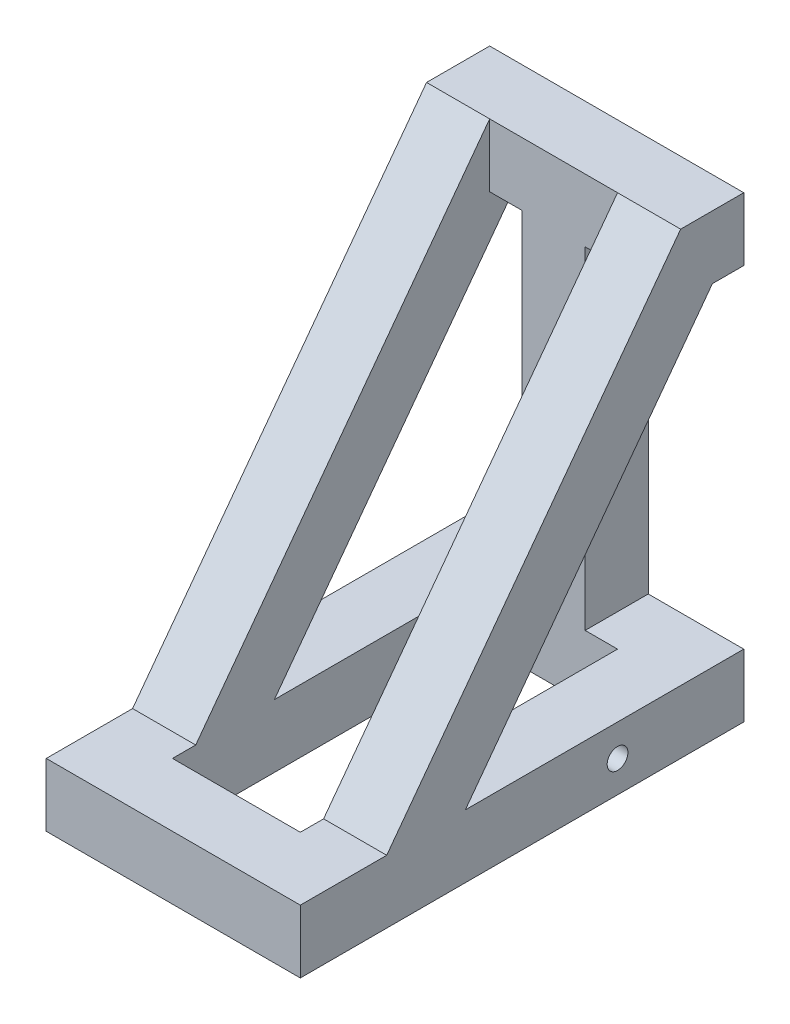
ISO-10303-21;
HEADER;
FILE_DESCRIPTION(('STEP AP214'),'2;1');
FILE_NAME('part.step','',(''),(''),'','','');
FILE_SCHEMA(('AUTOMOTIVE_DESIGN { 1 0 10303 214 1 1 1 1 }'));
ENDSEC;
DATA;
#1=APPLICATION_CONTEXT('core data for automotive mechanical design processes');
#2=APPLICATION_PROTOCOL_DEFINITION('international standard','automotive_design',2000,#1);
#3=PRODUCT_CONTEXT('',#1,'mechanical');
#4=PRODUCT('Part','Part','',(#3));
#5=PRODUCT_RELATED_PRODUCT_CATEGORY('part','',(#4));
#6=PRODUCT_DEFINITION_FORMATION('','',#4);
#7=PRODUCT_DEFINITION_CONTEXT('part definition',#1,'design');
#8=PRODUCT_DEFINITION('design','',#6,#7);
#9=PRODUCT_DEFINITION_SHAPE('','',#8);
#10=(LENGTH_UNIT() NAMED_UNIT(*) SI_UNIT(.MILLI.,.METRE.));
#11=(NAMED_UNIT(*) PLANE_ANGLE_UNIT() SI_UNIT($,.RADIAN.));
#12=(NAMED_UNIT(*) SI_UNIT($,.STERADIAN.) SOLID_ANGLE_UNIT());
#13=UNCERTAINTY_MEASURE_WITH_UNIT(LENGTH_MEASURE(1.E-05),#10,'distance_accuracy_value','');
#14=(GEOMETRIC_REPRESENTATION_CONTEXT(3) GLOBAL_UNCERTAINTY_ASSIGNED_CONTEXT((#13)) GLOBAL_UNIT_ASSIGNED_CONTEXT((#10,
#11,#12)) REPRESENTATION_CONTEXT('',''));
#15=CARTESIAN_POINT('',(0.,0.,0.));
#16=DIRECTION('',(0.,0.,1.));
#17=DIRECTION('',(1.,0.,0.));
#18=AXIS2_PLACEMENT_3D('',#15,#16,#17);
#19=CARTESIAN_POINT('',(-76.5,38.,133.5));
#20=DIRECTION('',(0.,1.,0.));
#21=DIRECTION('',(0.,0.,1.));
#22=AXIS2_PLACEMENT_3D('',#19,#20,#21);
#23=PLANE('',#22);
#24=DIRECTION('',(0.,0.,1.));
#25=VECTOR('',#24,1.);
#26=CARTESIAN_POINT('',(-38.5,38.,-95.5));
#27=LINE('',#26,#25);
#28=CARTESIAN_POINT('',(-38.5,38.,81.5));
#29=VERTEX_POINT('',#28);
#30=CARTESIAN_POINT('',(-38.5,38.,95.5));
#31=VERTEX_POINT('',#30);
#32=EDGE_CURVE('E218',#29,#31,#27,.T.);
#33=ORIENTED_EDGE('',*,*,#32,.F.);
#34=DIRECTION('',(-1.,0.,0.));
#35=VECTOR('',#34,1.);
#36=CARTESIAN_POINT('',(-38.5,38.,81.5));
#37=LINE('',#36,#35);
#38=CARTESIAN_POINT('',(-76.5,38.,81.5));
#39=VERTEX_POINT('',#38);
#40=EDGE_CURVE('E52',#29,#39,#37,.T.);
#41=ORIENTED_EDGE('',*,*,#40,.T.);
#42=DIRECTION('',(0.,0.,1.));
#43=VECTOR('',#42,1.);
#44=CARTESIAN_POINT('',(-76.5,38.,-133.5));
#45=LINE('',#44,#43);
#46=CARTESIAN_POINT('',(-76.5,38.,133.5));
#47=VERTEX_POINT('',#46);
#48=EDGE_CURVE('E262',#39,#47,#45,.T.);
#49=ORIENTED_EDGE('',*,*,#48,.T.);
#50=DIRECTION('',(1.,0.,0.));
#51=VECTOR('',#50,1.);
#52=CARTESIAN_POINT('',(-76.5,38.,133.5));
#53=LINE('',#52,#51);
#54=CARTESIAN_POINT('',(76.5,38.,133.5));
#55=VERTEX_POINT('',#54);
#56=EDGE_CURVE('E293',#47,#55,#53,.T.);
#57=ORIENTED_EDGE('',*,*,#56,.T.);
#58=DIRECTION('',(0.,0.,-1.));
#59=VECTOR('',#58,1.);
#60=CARTESIAN_POINT('',(76.5,38.,-133.5));
#61=LINE('',#60,#59);
#62=CARTESIAN_POINT('',(76.5,38.,81.5));
#63=VERTEX_POINT('',#62);
#64=EDGE_CURVE('E246',#55,#63,#61,.T.);
#65=ORIENTED_EDGE('',*,*,#64,.T.);
#66=DIRECTION('',(1.,0.,0.));
#67=VECTOR('',#66,1.);
#68=CARTESIAN_POINT('',(38.5,38.,81.5));
#69=LINE('',#68,#67);
#70=CARTESIAN_POINT('',(38.5,38.,81.5));
#71=VERTEX_POINT('',#70);
#72=EDGE_CURVE('E389',#71,#63,#69,.T.);
#73=ORIENTED_EDGE('',*,*,#72,.F.);
#74=DIRECTION('',(0.,0.,-1.));
#75=VECTOR('',#74,1.);
#76=CARTESIAN_POINT('',(38.5,38.,-95.5));
#77=LINE('',#76,#75);
#78=CARTESIAN_POINT('',(38.5,38.,95.5));
#79=VERTEX_POINT('',#78);
#80=EDGE_CURVE('E227',#79,#71,#77,.T.);
#81=ORIENTED_EDGE('',*,*,#80,.F.);
#82=DIRECTION('',(1.,0.,0.));
#83=VECTOR('',#82,1.);
#84=CARTESIAN_POINT('',(-38.5,38.,95.5));
#85=LINE('',#84,#83);
#86=EDGE_CURVE('E217',#31,#79,#85,.T.);
#87=ORIENTED_EDGE('',*,*,#86,.F.);
#88=EDGE_LOOP('',(#33,#41,#49,#57,#65,#73,#81,#87));
#89=FACE_BOUND('',#88,.T.);
#90=ADVANCED_FACE('F35',(#89),#23,.T.);
#91=CARTESIAN_POINT('',(-76.5,38.,-133.5));
#92=VERTEX_POINT('',#91);
#93=CARTESIAN_POINT('',(-76.5,38.,34.14330989466));
#94=VERTEX_POINT('',#93);
#95=EDGE_CURVE('E211',#92,#94,#45,.T.);
#96=ORIENTED_EDGE('',*,*,#95,.T.);
#97=DIRECTION('',(-1.,0.,0.));
#98=VECTOR('',#97,1.);
#99=CARTESIAN_POINT('',(-38.5,38.,34.14330989466));
#100=LINE('',#99,#98);
#101=CARTESIAN_POINT('',(-38.5,38.,34.14330989466));
#102=VERTEX_POINT('',#101);
#103=EDGE_CURVE('E198',#102,#94,#100,.T.);
#104=ORIENTED_EDGE('',*,*,#103,.F.);
#105=CARTESIAN_POINT('',(-38.5,38.,-95.5));
#106=VERTEX_POINT('',#105);
#107=EDGE_CURVE('E209',#106,#102,#27,.T.);
#108=ORIENTED_EDGE('',*,*,#107,.F.);
#109=DIRECTION('',(-1.,0.,0.));
#110=VECTOR('',#109,1.);
#111=CARTESIAN_POINT('',(-38.5,38.,-95.5));
#112=LINE('',#111,#110);
#113=CARTESIAN_POINT('',(-19.,38.,-95.5));
#114=VERTEX_POINT('',#113);
#115=EDGE_CURVE('E230',#114,#106,#112,.T.);
#116=ORIENTED_EDGE('',*,*,#115,.F.);
#117=DIRECTION('',(0.,0.,1.));
#118=VECTOR('',#117,1.);
#119=CARTESIAN_POINT('',(-19.,38.,-133.5));
#120=LINE('',#119,#118);
#121=CARTESIAN_POINT('',(-19.,38.,-133.5));
#122=VERTEX_POINT('',#121);
#123=EDGE_CURVE('E326',#122,#114,#120,.T.);
#124=ORIENTED_EDGE('',*,*,#123,.F.);
#125=DIRECTION('',(-1.,0.,0.));
#126=VECTOR('',#125,1.);
#127=CARTESIAN_POINT('',(-76.5,38.,-133.5));
#128=LINE('',#127,#126);
#129=EDGE_CURVE('E242',#122,#92,#128,.T.);
#130=ORIENTED_EDGE('',*,*,#129,.T.);
#131=EDGE_LOOP('',(#96,#104,#108,#116,#124,#130));
#132=FACE_BOUND('',#131,.T.);
#133=ADVANCED_FACE('F208',(#132),#23,.T.);
#134=CARTESIAN_POINT('',(-76.5,238.,-95.5));
#135=DIRECTION('',(0.,-1.,0.));
#136=DIRECTION('',(0.,0.,-1.));
#137=AXIS2_PLACEMENT_3D('',#134,#135,#136);
#138=PLANE('',#137);
#139=DIRECTION('',(0.,0.,1.));
#140=VECTOR('',#139,1.);
#141=CARTESIAN_POINT('',(-38.5,238.,-114.596185903659));
#142=LINE('',#141,#140);
#143=CARTESIAN_POINT('',(-38.5,238.,-114.596185903659));
#144=VERTEX_POINT('',#143);
#145=CARTESIAN_POINT('',(-38.5,238.,-95.5));
#146=VERTEX_POINT('',#145);
#147=EDGE_CURVE('E60',#144,#146,#142,.T.);
#148=ORIENTED_EDGE('',*,*,#147,.F.);
#149=DIRECTION('',(-1.,0.,0.));
#150=VECTOR('',#149,1.);
#151=CARTESIAN_POINT('',(-38.5,238.,-114.596185903659));
#152=LINE('',#151,#150);
#153=CARTESIAN_POINT('',(-76.5,238.,-114.596185903659));
#154=VERTEX_POINT('',#153);
#155=EDGE_CURVE('E200',#144,#154,#152,.T.);
#156=ORIENTED_EDGE('',*,*,#155,.T.);
#157=DIRECTION('',(0.,0.,-1.));
#158=VECTOR('',#157,1.);
#159=CARTESIAN_POINT('',(-76.5,238.,-95.5));
#160=LINE('',#159,#158);
#161=CARTESIAN_POINT('',(-76.5,238.,-133.5));
#162=VERTEX_POINT('',#161);
#163=EDGE_CURVE('E376',#154,#162,#160,.T.);
#164=ORIENTED_EDGE('',*,*,#163,.T.);
#165=DIRECTION('',(1.,0.,0.));
#166=VECTOR('',#165,1.);
#167=CARTESIAN_POINT('',(-76.5,238.,-133.5));
#168=LINE('',#167,#166);
#169=CARTESIAN_POINT('',(-19.,238.,-133.5));
#170=VERTEX_POINT('',#169);
#171=EDGE_CURVE('E354',#162,#170,#168,.T.);
#172=ORIENTED_EDGE('',*,*,#171,.T.);
#173=DIRECTION('',(0.,0.,1.));
#174=VECTOR('',#173,1.);
#175=CARTESIAN_POINT('',(-19.,238.,-133.5));
#176=LINE('',#175,#174);
#177=CARTESIAN_POINT('',(-19.,238.,-95.5));
#178=VERTEX_POINT('',#177);
#179=EDGE_CURVE('E342',#170,#178,#176,.T.);
#180=ORIENTED_EDGE('',*,*,#179,.T.);
#181=DIRECTION('',(1.,0.,0.));
#182=VECTOR('',#181,1.);
#183=CARTESIAN_POINT('',(-76.5,238.,-95.5));
#184=LINE('',#183,#182);
#185=EDGE_CURVE('E345',#146,#178,#184,.T.);
#186=ORIENTED_EDGE('',*,*,#185,.F.);
#187=EDGE_LOOP('',(#148,#156,#164,#172,#180,#186));
#188=FACE_BOUND('',#187,.T.);
#189=ADVANCED_FACE('F494',(#188),#138,.T.);
#190=DIRECTION('',(1.,0.,0.));
#191=VECTOR('',#190,1.);
#192=CARTESIAN_POINT('',(38.5,38.,34.14330989466));
#193=LINE('',#192,#191);
#194=CARTESIAN_POINT('',(38.5,38.,34.14330989466));
#195=VERTEX_POINT('',#194);
#196=CARTESIAN_POINT('',(76.5,38.,34.14330989466));
#197=VERTEX_POINT('',#196);
#198=EDGE_CURVE('E392',#195,#197,#193,.T.);
#199=ORIENTED_EDGE('',*,*,#198,.T.);
#200=CARTESIAN_POINT('',(76.5,38.,-133.5));
#201=VERTEX_POINT('',#200);
#202=EDGE_CURVE('E295',#197,#201,#61,.T.);
#203=ORIENTED_EDGE('',*,*,#202,.T.);
#204=CARTESIAN_POINT('',(19.,38.,-133.5));
#205=VERTEX_POINT('',#204);
#206=EDGE_CURVE('E245',#201,#205,#128,.T.);
#207=ORIENTED_EDGE('',*,*,#206,.T.);
#208=DIRECTION('',(0.,0.,-1.));
#209=VECTOR('',#208,1.);
#210=CARTESIAN_POINT('',(19.,38.,-133.5));
#211=LINE('',#210,#209);
#212=CARTESIAN_POINT('',(19.,38.,-95.5));
#213=VERTEX_POINT('',#212);
#214=EDGE_CURVE('E328',#213,#205,#211,.T.);
#215=ORIENTED_EDGE('',*,*,#214,.F.);
#216=CARTESIAN_POINT('',(38.5,38.,-95.5));
#217=VERTEX_POINT('',#216);
#218=EDGE_CURVE('E239',#217,#213,#112,.T.);
#219=ORIENTED_EDGE('',*,*,#218,.F.);
#220=EDGE_CURVE('E220',#195,#217,#77,.T.);
#221=ORIENTED_EDGE('',*,*,#220,.F.);
#222=EDGE_LOOP('',(#199,#203,#207,#215,#219,#221));
#223=FACE_BOUND('',#222,.T.);
#224=ADVANCED_FACE('F460',(#223),#23,.T.);
#225=CARTESIAN_POINT('',(-76.5,0.,133.5));
#226=DIRECTION('',(0.,1.,0.));
#227=DIRECTION('',(0.,0.,1.));
#228=AXIS2_PLACEMENT_3D('',#225,#226,#227);
#229=PLANE('',#228);
#230=DIRECTION('',(0.,0.,1.));
#231=VECTOR('',#230,1.);
#232=CARTESIAN_POINT('',(-76.5,0.,-133.5));
#233=LINE('',#232,#231);
#234=CARTESIAN_POINT('',(-76.5,0.,-133.5));
#235=VERTEX_POINT('',#234);
#236=CARTESIAN_POINT('',(-76.5,0.,133.5));
#237=VERTEX_POINT('',#236);
#238=EDGE_CURVE('E251',#235,#237,#233,.T.);
#239=ORIENTED_EDGE('',*,*,#238,.F.);
#240=DIRECTION('',(-1.,0.,0.));
#241=VECTOR('',#240,1.);
#242=CARTESIAN_POINT('',(-76.5,0.,-133.5));
#243=LINE('',#242,#241);
#244=CARTESIAN_POINT('',(76.5,0.,-133.5));
#245=VERTEX_POINT('',#244);
#246=EDGE_CURVE('E260',#245,#235,#243,.T.);
#247=ORIENTED_EDGE('',*,*,#246,.F.);
#248=DIRECTION('',(0.,0.,-1.));
#249=VECTOR('',#248,1.);
#250=CARTESIAN_POINT('',(76.5,0.,-133.5));
#251=LINE('',#250,#249);
#252=CARTESIAN_POINT('',(76.5,0.,133.5));
#253=VERTEX_POINT('',#252);
#254=EDGE_CURVE('E258',#253,#245,#251,.T.);
#255=ORIENTED_EDGE('',*,*,#254,.F.);
#256=DIRECTION('',(1.,0.,0.));
#257=VECTOR('',#256,1.);
#258=CARTESIAN_POINT('',(-76.5,0.,133.5));
#259=LINE('',#258,#257);
#260=EDGE_CURVE('E255',#237,#253,#259,.T.);
#261=ORIENTED_EDGE('',*,*,#260,.F.);
#262=EDGE_LOOP('',(#239,#247,#255,#261));
#263=FACE_BOUND('',#262,.T.);
#264=DIRECTION('',(0.,0.,1.));
#265=VECTOR('',#264,1.);
#266=CARTESIAN_POINT('',(-38.5,0.,-95.5));
#267=LINE('',#266,#265);
#268=CARTESIAN_POINT('',(-38.5,0.,-95.5));
#269=VERTEX_POINT('',#268);
#270=CARTESIAN_POINT('',(-38.5,0.,95.5));
#271=VERTEX_POINT('',#270);
#272=EDGE_CURVE('E233',#269,#271,#267,.T.);
#273=ORIENTED_EDGE('',*,*,#272,.T.);
#274=DIRECTION('',(1.,0.,0.));
#275=VECTOR('',#274,1.);
#276=CARTESIAN_POINT('',(-38.5,0.,95.5));
#277=LINE('',#276,#275);
#278=CARTESIAN_POINT('',(38.5,0.,95.5));
#279=VERTEX_POINT('',#278);
#280=EDGE_CURVE('E308',#271,#279,#277,.T.);
#281=ORIENTED_EDGE('',*,*,#280,.T.);
#282=DIRECTION('',(0.,0.,-1.));
#283=VECTOR('',#282,1.);
#284=CARTESIAN_POINT('',(38.5,0.,-95.5));
#285=LINE('',#284,#283);
#286=CARTESIAN_POINT('',(38.5,0.,-95.5));
#287=VERTEX_POINT('',#286);
#288=EDGE_CURVE('E306',#279,#287,#285,.T.);
#289=ORIENTED_EDGE('',*,*,#288,.T.);
#290=DIRECTION('',(-1.,0.,0.));
#291=VECTOR('',#290,1.);
#292=CARTESIAN_POINT('',(-38.5,0.,-95.5));
#293=LINE('',#292,#291);
#294=EDGE_CURVE('E222',#287,#269,#293,.T.);
#295=ORIENTED_EDGE('',*,*,#294,.T.);
#296=EDGE_LOOP('',(#273,#281,#289,#295));
#297=FACE_BOUND('',#296,.T.);
#298=ADVANCED_FACE('F283',(#263,#297),#229,.F.);
#299=CARTESIAN_POINT('',(-76.5,38.,-133.5));
#300=DIRECTION('',(1.,0.,0.));
#301=DIRECTION('',(0.,0.,-1.));
#302=AXIS2_PLACEMENT_3D('',#299,#300,#301);
#303=PLANE('',#302);
#304=CARTESIAN_POINT('',(-76.5,19.,-57.5));
#305=DIRECTION('',(1.,0.,0.));
#306=DIRECTION('',(0.,0.,-1.));
#307=AXIS2_PLACEMENT_3D('',#304,#305,#306);
#308=CIRCLE('',#307,6.25);
#309=CARTESIAN_POINT('',(-76.5,19.,-63.75));
#310=VERTEX_POINT('',#309);
#311=EDGE_CURVE('E416',#310,#310,#308,.T.);
#312=ORIENTED_EDGE('',*,*,#311,.T.);
#313=EDGE_LOOP('',(#312));
#314=FACE_BOUND('',#313,.T.);
#315=ORIENTED_EDGE('',*,*,#238,.T.);
#316=DIRECTION('',(0.,-1.,0.));
#317=VECTOR('',#316,1.);
#318=CARTESIAN_POINT('',(-76.5,38.,133.5));
#319=LINE('',#318,#317);
#320=EDGE_CURVE('E11',#47,#237,#319,.T.);
#321=ORIENTED_EDGE('',*,*,#320,.F.);
#322=ORIENTED_EDGE('',*,*,#48,.F.);
#323=DIRECTION('',(0.,-0.802420944442547,0.596758433471979));
#324=VECTOR('',#323,1.);
#325=CARTESIAN_POINT('',(-76.5,276.,-95.5));
#326=LINE('',#325,#324);
#327=CARTESIAN_POINT('',(-76.5,276.,-95.5));
#328=VERTEX_POINT('',#327);
#329=EDGE_CURVE('E412',#328,#39,#326,.T.);
#330=ORIENTED_EDGE('',*,*,#329,.F.);
#331=DIRECTION('',(0.,0.,1.));
#332=VECTOR('',#331,1.);
#333=CARTESIAN_POINT('',(-76.5,276.,-95.5));
#334=LINE('',#333,#332);
#335=CARTESIAN_POINT('',(-76.5,276.,-133.5));
#336=VERTEX_POINT('',#335);
#337=EDGE_CURVE('E358',#336,#328,#334,.T.);
#338=ORIENTED_EDGE('',*,*,#337,.F.);
#339=DIRECTION('',(0.,1.,0.));
#340=VECTOR('',#339,1.);
#341=CARTESIAN_POINT('',(-76.5,238.,-133.5));
#342=LINE('',#341,#340);
#343=EDGE_CURVE('E374',#162,#336,#342,.T.);
#344=ORIENTED_EDGE('',*,*,#343,.F.);
#345=ORIENTED_EDGE('',*,*,#163,.F.);
#346=DIRECTION('',(0.,0.802420944442548,-0.596758433471979));
#347=VECTOR('',#346,1.);
#348=CARTESIAN_POINT('',(-76.5,38.,34.14330989466));
#349=LINE('',#348,#347);
#350=EDGE_CURVE('E292',#94,#154,#349,.T.);
#351=ORIENTED_EDGE('',*,*,#350,.F.);
#352=ORIENTED_EDGE('',*,*,#95,.F.);
#353=DIRECTION('',(0.,-1.,0.));
#354=VECTOR('',#353,1.);
#355=CARTESIAN_POINT('',(-76.5,38.,-133.5));
#356=LINE('',#355,#354);
#357=EDGE_CURVE('E263',#92,#235,#356,.T.);
#358=ORIENTED_EDGE('',*,*,#357,.T.);
#359=EDGE_LOOP('',(#315,#321,#322,#330,#338,#344,#345,#351,#352,#358));
#360=FACE_BOUND('',#359,.T.);
#361=ADVANCED_FACE('F37',(#314,#360),#303,.F.);
#362=CARTESIAN_POINT('',(-76.5,38.,133.5));
#363=DIRECTION('',(0.,0.,-1.));
#364=DIRECTION('',(-1.,0.,0.));
#365=AXIS2_PLACEMENT_3D('',#362,#363,#364);
#366=PLANE('',#365);
#367=ORIENTED_EDGE('',*,*,#260,.T.);
#368=DIRECTION('',(0.,-1.,0.));
#369=VECTOR('',#368,1.);
#370=CARTESIAN_POINT('',(76.5,38.,133.5));
#371=LINE('',#370,#369);
#372=EDGE_CURVE('E44',#55,#253,#371,.T.);
#373=ORIENTED_EDGE('',*,*,#372,.F.);
#374=ORIENTED_EDGE('',*,*,#56,.F.);
#375=ORIENTED_EDGE('',*,*,#320,.T.);
#376=EDGE_LOOP('',(#367,#373,#374,#375));
#377=FACE_BOUND('',#376,.T.);
#378=ADVANCED_FACE('F539',(#377),#366,.F.);
#379=CARTESIAN_POINT('',(76.5,38.,-133.5));
#380=DIRECTION('',(-1.,0.,0.));
#381=DIRECTION('',(0.,0.,1.));
#382=AXIS2_PLACEMENT_3D('',#379,#380,#381);
#383=PLANE('',#382);
#384=CARTESIAN_POINT('',(76.5,19.,-57.5));
#385=DIRECTION('',(1.,0.,0.));
#386=DIRECTION('',(0.,0.,-1.));
#387=AXIS2_PLACEMENT_3D('',#384,#385,#386);
#388=CIRCLE('',#387,6.25);
#389=CARTESIAN_POINT('',(76.5,19.,-63.75));
#390=VERTEX_POINT('',#389);
#391=EDGE_CURVE('E426',#390,#390,#388,.T.);
#392=ORIENTED_EDGE('',*,*,#391,.F.);
#393=EDGE_LOOP('',(#392));
#394=FACE_BOUND('',#393,.T.);
#395=ORIENTED_EDGE('',*,*,#254,.T.);
#396=DIRECTION('',(0.,-1.,0.));
#397=VECTOR('',#396,1.);
#398=CARTESIAN_POINT('',(76.5,38.,-133.5));
#399=LINE('',#398,#397);
#400=EDGE_CURVE('E266',#201,#245,#399,.T.);
#401=ORIENTED_EDGE('',*,*,#400,.F.);
#402=ORIENTED_EDGE('',*,*,#202,.F.);
#403=DIRECTION('',(0.,0.802420944442548,-0.596758433471979));
#404=VECTOR('',#403,1.);
#405=CARTESIAN_POINT('',(76.5,38.,34.14330989466));
#406=LINE('',#405,#404);
#407=CARTESIAN_POINT('',(76.5,238.,-114.596185903659));
#408=VERTEX_POINT('',#407);
#409=EDGE_CURVE('E397',#197,#408,#406,.T.);
#410=ORIENTED_EDGE('',*,*,#409,.T.);
#411=DIRECTION('',(0.,0.,-1.));
#412=VECTOR('',#411,1.);
#413=CARTESIAN_POINT('',(76.5,238.,-95.5));
#414=LINE('',#413,#412);
#415=CARTESIAN_POINT('',(76.5,238.,-133.5));
#416=VERTEX_POINT('',#415);
#417=EDGE_CURVE('E383',#408,#416,#414,.T.);
#418=ORIENTED_EDGE('',*,*,#417,.T.);
#419=DIRECTION('',(0.,1.,0.));
#420=VECTOR('',#419,1.);
#421=CARTESIAN_POINT('',(76.5,238.,-133.5));
#422=LINE('',#421,#420);
#423=CARTESIAN_POINT('',(76.5,276.,-133.5));
#424=VERTEX_POINT('',#423);
#425=EDGE_CURVE('E381',#416,#424,#422,.T.);
#426=ORIENTED_EDGE('',*,*,#425,.T.);
#427=DIRECTION('',(0.,0.,1.));
#428=VECTOR('',#427,1.);
#429=CARTESIAN_POINT('',(76.5,276.,-95.5));
#430=LINE('',#429,#428);
#431=CARTESIAN_POINT('',(76.5,276.,-95.5));
#432=VERTEX_POINT('',#431);
#433=EDGE_CURVE('E378',#424,#432,#430,.T.);
#434=ORIENTED_EDGE('',*,*,#433,.T.);
#435=DIRECTION('',(0.,-0.802420944442547,0.596758433471979));
#436=VECTOR('',#435,1.);
#437=CARTESIAN_POINT('',(76.5,276.,-95.5));
#438=LINE('',#437,#436);
#439=EDGE_CURVE('E400',#432,#63,#438,.T.);
#440=ORIENTED_EDGE('',*,*,#439,.T.);
#441=ORIENTED_EDGE('',*,*,#64,.F.);
#442=ORIENTED_EDGE('',*,*,#372,.T.);
#443=EDGE_LOOP('',(#395,#401,#402,#410,#418,#426,#434,#440,#441,#442));
#444=FACE_BOUND('',#443,.T.);
#445=ADVANCED_FACE('F274',(#394,#444),#383,.F.);
#446=CARTESIAN_POINT('',(-76.5,38.,-133.5));
#447=DIRECTION('',(0.,0.,1.));
#448=DIRECTION('',(1.,0.,0.));
#449=AXIS2_PLACEMENT_3D('',#446,#447,#448);
#450=PLANE('',#449);
#451=ORIENTED_EDGE('',*,*,#246,.T.);
#452=ORIENTED_EDGE('',*,*,#357,.F.);
#453=ORIENTED_EDGE('',*,*,#129,.F.);
#454=DIRECTION('',(0.,-1.,0.));
#455=VECTOR('',#454,1.);
#456=CARTESIAN_POINT('',(-19.,238.,-133.5));
#457=LINE('',#456,#455);
#458=EDGE_CURVE('E330',#170,#122,#457,.T.);
#459=ORIENTED_EDGE('',*,*,#458,.F.);
#460=ORIENTED_EDGE('',*,*,#171,.F.);
#461=ORIENTED_EDGE('',*,*,#343,.T.);
#462=DIRECTION('',(1.,0.,0.));
#463=VECTOR('',#462,1.);
#464=CARTESIAN_POINT('',(-76.5,276.,-133.5));
#465=LINE('',#464,#463);
#466=EDGE_CURVE('E365',#336,#424,#465,.T.);
#467=ORIENTED_EDGE('',*,*,#466,.T.);
#468=ORIENTED_EDGE('',*,*,#425,.F.);
#469=CARTESIAN_POINT('',(19.,238.,-133.5));
#470=VERTEX_POINT('',#469);
#471=EDGE_CURVE('E347',#470,#416,#168,.T.);
#472=ORIENTED_EDGE('',*,*,#471,.F.);
#473=DIRECTION('',(0.,-1.,0.));
#474=VECTOR('',#473,1.);
#475=CARTESIAN_POINT('',(19.,238.,-133.5));
#476=LINE('',#475,#474);
#477=EDGE_CURVE('E319',#470,#205,#476,.T.);
#478=ORIENTED_EDGE('',*,*,#477,.T.);
#479=ORIENTED_EDGE('',*,*,#206,.F.);
#480=ORIENTED_EDGE('',*,*,#400,.T.);
#481=EDGE_LOOP('',(#451,#452,#453,#459,#460,#461,#467,#468,#472,#478,#479,#480));
#482=FACE_BOUND('',#481,.T.);
#483=ADVANCED_FACE('F287',(#482),#450,.F.);
#484=CARTESIAN_POINT('',(-38.5,38.,-95.5));
#485=DIRECTION('',(1.,0.,0.));
#486=DIRECTION('',(0.,0.,-1.));
#487=AXIS2_PLACEMENT_3D('',#484,#485,#486);
#488=PLANE('',#487);
#489=CARTESIAN_POINT('',(-38.5,19.,-57.5));
#490=DIRECTION('',(1.,0.,0.));
#491=DIRECTION('',(0.,0.,-1.));
#492=AXIS2_PLACEMENT_3D('',#489,#490,#491);
#493=CIRCLE('',#492,6.25);
#494=CARTESIAN_POINT('',(-38.5,19.,-63.75));
#495=VERTEX_POINT('',#494);
#496=EDGE_CURVE('E423',#495,#495,#493,.T.);
#497=ORIENTED_EDGE('',*,*,#496,.F.);
#498=EDGE_LOOP('',(#497));
#499=FACE_BOUND('',#498,.T.);
#500=ORIENTED_EDGE('',*,*,#272,.F.);
#501=DIRECTION('',(0.,-1.,0.));
#502=VECTOR('',#501,1.);
#503=CARTESIAN_POINT('',(-38.5,38.,-95.5));
#504=LINE('',#503,#502);
#505=EDGE_CURVE('E216',#106,#269,#504,.T.);
#506=ORIENTED_EDGE('',*,*,#505,.F.);
#507=ORIENTED_EDGE('',*,*,#107,.T.);
#508=DIRECTION('',(0.,0.802420944442548,-0.596758433471979));
#509=VECTOR('',#508,1.);
#510=CARTESIAN_POINT('',(-38.5,38.,34.14330989466));
#511=LINE('',#510,#509);
#512=EDGE_CURVE('E194',#102,#144,#511,.T.);
#513=ORIENTED_EDGE('',*,*,#512,.T.);
#514=ORIENTED_EDGE('',*,*,#147,.T.);
#515=DIRECTION('',(0.,1.,0.));
#516=VECTOR('',#515,1.);
#517=CARTESIAN_POINT('',(-38.5,238.,-95.5));
#518=LINE('',#517,#516);
#519=CARTESIAN_POINT('',(-38.5,276.,-95.5));
#520=VERTEX_POINT('',#519);
#521=EDGE_CURVE('E414',#146,#520,#518,.T.);
#522=ORIENTED_EDGE('',*,*,#521,.T.);
#523=DIRECTION('',(0.,-0.802420944442547,0.596758433471979));
#524=VECTOR('',#523,1.);
#525=CARTESIAN_POINT('',(-38.5,276.,-95.5));
#526=LINE('',#525,#524);
#527=EDGE_CURVE('E203',#520,#29,#526,.T.);
#528=ORIENTED_EDGE('',*,*,#527,.T.);
#529=ORIENTED_EDGE('',*,*,#32,.T.);
#530=DIRECTION('',(0.,-1.,0.));
#531=VECTOR('',#530,1.);
#532=CARTESIAN_POINT('',(-38.5,38.,95.5));
#533=LINE('',#532,#531);
#534=EDGE_CURVE('E256',#31,#271,#533,.T.);
#535=ORIENTED_EDGE('',*,*,#534,.T.);
#536=EDGE_LOOP('',(#500,#506,#507,#513,#514,#522,#528,#529,#535));
#537=FACE_BOUND('',#536,.T.);
#538=ADVANCED_FACE('F214',(#499,#537),#488,.T.);
#539=CARTESIAN_POINT('',(-38.5,38.,95.5));
#540=DIRECTION('',(0.,0.,-1.));
#541=DIRECTION('',(-1.,0.,0.));
#542=AXIS2_PLACEMENT_3D('',#539,#540,#541);
#543=PLANE('',#542);
#544=ORIENTED_EDGE('',*,*,#280,.F.);
#545=ORIENTED_EDGE('',*,*,#534,.F.);
#546=ORIENTED_EDGE('',*,*,#86,.T.);
#547=DIRECTION('',(0.,-1.,0.));
#548=VECTOR('',#547,1.);
#549=CARTESIAN_POINT('',(38.5,38.,95.5));
#550=LINE('',#549,#548);
#551=EDGE_CURVE('E299',#79,#279,#550,.T.);
#552=ORIENTED_EDGE('',*,*,#551,.T.);
#553=EDGE_LOOP('',(#544,#545,#546,#552));
#554=FACE_BOUND('',#553,.T.);
#555=ADVANCED_FACE('F439',(#554),#543,.T.);
#556=CARTESIAN_POINT('',(38.5,38.,-95.5));
#557=DIRECTION('',(-1.,0.,0.));
#558=DIRECTION('',(0.,0.,1.));
#559=AXIS2_PLACEMENT_3D('',#556,#557,#558);
#560=PLANE('',#559);
#561=CARTESIAN_POINT('',(38.5,19.,-57.5));
#562=DIRECTION('',(-1.,0.,0.));
#563=DIRECTION('',(0.,0.,1.));
#564=AXIS2_PLACEMENT_3D('',#561,#562,#563);
#565=CIRCLE('',#564,6.25);
#566=CARTESIAN_POINT('',(38.5,19.,-51.25));
#567=VERTEX_POINT('',#566);
#568=EDGE_CURVE('E39',#567,#567,#565,.T.);
#569=ORIENTED_EDGE('',*,*,#568,.F.);
#570=EDGE_LOOP('',(#569));
#571=FACE_BOUND('',#570,.T.);
#572=ORIENTED_EDGE('',*,*,#288,.F.);
#573=ORIENTED_EDGE('',*,*,#551,.F.);
#574=ORIENTED_EDGE('',*,*,#80,.T.);
#575=DIRECTION('',(0.,-0.802420944442547,0.596758433471979));
#576=VECTOR('',#575,1.);
#577=CARTESIAN_POINT('',(38.5,276.,-95.5));
#578=LINE('',#577,#576);
#579=CARTESIAN_POINT('',(38.5,276.,-95.5));
#580=VERTEX_POINT('',#579);
#581=EDGE_CURVE('E406',#580,#71,#578,.T.);
#582=ORIENTED_EDGE('',*,*,#581,.F.);
#583=DIRECTION('',(0.,1.,0.));
#584=VECTOR('',#583,1.);
#585=CARTESIAN_POINT('',(38.5,238.,-95.5));
#586=LINE('',#585,#584);
#587=CARTESIAN_POINT('',(38.5,238.,-95.5));
#588=VERTEX_POINT('',#587);
#589=EDGE_CURVE('E399',#588,#580,#586,.T.);
#590=ORIENTED_EDGE('',*,*,#589,.F.);
#591=DIRECTION('',(0.,0.,1.));
#592=VECTOR('',#591,1.);
#593=CARTESIAN_POINT('',(38.5,238.,-114.596185903659));
#594=LINE('',#593,#592);
#595=CARTESIAN_POINT('',(38.5,238.,-114.596185903659));
#596=VERTEX_POINT('',#595);
#597=EDGE_CURVE('E390',#596,#588,#594,.T.);
#598=ORIENTED_EDGE('',*,*,#597,.F.);
#599=DIRECTION('',(0.,0.802420944442548,-0.596758433471979));
#600=VECTOR('',#599,1.);
#601=CARTESIAN_POINT('',(38.5,38.,34.14330989466));
#602=LINE('',#601,#600);
#603=EDGE_CURVE('E404',#195,#596,#602,.T.);
#604=ORIENTED_EDGE('',*,*,#603,.F.);
#605=ORIENTED_EDGE('',*,*,#220,.T.);
#606=DIRECTION('',(0.,-1.,0.));
#607=VECTOR('',#606,1.);
#608=CARTESIAN_POINT('',(38.5,38.,-95.5));
#609=LINE('',#608,#607);
#610=EDGE_CURVE('E301',#217,#287,#609,.T.);
#611=ORIENTED_EDGE('',*,*,#610,.T.);
#612=EDGE_LOOP('',(#572,#573,#574,#582,#590,#598,#604,#605,#611));
#613=FACE_BOUND('',#612,.T.);
#614=ADVANCED_FACE('F435',(#571,#613),#560,.T.);
#615=CARTESIAN_POINT('',(-38.5,38.,-95.5));
#616=DIRECTION('',(0.,0.,1.));
#617=DIRECTION('',(1.,0.,0.));
#618=AXIS2_PLACEMENT_3D('',#615,#616,#617);
#619=PLANE('',#618);
#620=ORIENTED_EDGE('',*,*,#521,.F.);
#621=ORIENTED_EDGE('',*,*,#185,.T.);
#622=DIRECTION('',(0.,-1.,0.));
#623=VECTOR('',#622,1.);
#624=CARTESIAN_POINT('',(-19.,238.,-95.5));
#625=LINE('',#624,#623);
#626=EDGE_CURVE('E311',#178,#114,#625,.T.);
#627=ORIENTED_EDGE('',*,*,#626,.T.);
#628=ORIENTED_EDGE('',*,*,#115,.T.);
#629=ORIENTED_EDGE('',*,*,#505,.T.);
#630=ORIENTED_EDGE('',*,*,#294,.F.);
#631=ORIENTED_EDGE('',*,*,#610,.F.);
#632=ORIENTED_EDGE('',*,*,#218,.T.);
#633=DIRECTION('',(0.,-1.,0.));
#634=VECTOR('',#633,1.);
#635=CARTESIAN_POINT('',(19.,238.,-95.5));
#636=LINE('',#635,#634);
#637=CARTESIAN_POINT('',(19.,238.,-95.5));
#638=VERTEX_POINT('',#637);
#639=EDGE_CURVE('E313',#638,#213,#636,.T.);
#640=ORIENTED_EDGE('',*,*,#639,.F.);
#641=EDGE_CURVE('E348',#638,#588,#184,.T.);
#642=ORIENTED_EDGE('',*,*,#641,.T.);
#643=ORIENTED_EDGE('',*,*,#589,.T.);
#644=DIRECTION('',(1.,0.,0.));
#645=VECTOR('',#644,1.);
#646=CARTESIAN_POINT('',(-76.5,276.,-95.5));
#647=LINE('',#646,#645);
#648=EDGE_CURVE('E367',#520,#580,#647,.T.);
#649=ORIENTED_EDGE('',*,*,#648,.F.);
#650=EDGE_LOOP('',(#620,#621,#627,#628,#629,#630,#631,#632,#640,#642,#643,#649));
#651=FACE_BOUND('',#650,.T.);
#652=ADVANCED_FACE('F438',(#651),#619,.T.);
#653=CARTESIAN_POINT('',(-19.,238.,-133.5));
#654=DIRECTION('',(1.,0.,0.));
#655=DIRECTION('',(0.,0.,-1.));
#656=AXIS2_PLACEMENT_3D('',#653,#654,#655);
#657=PLANE('',#656);
#658=ORIENTED_EDGE('',*,*,#123,.T.);
#659=ORIENTED_EDGE('',*,*,#626,.F.);
#660=ORIENTED_EDGE('',*,*,#179,.F.);
#661=ORIENTED_EDGE('',*,*,#458,.T.);
#662=EDGE_LOOP('',(#658,#659,#660,#661));
#663=FACE_BOUND('',#662,.T.);
#664=ADVANCED_FACE('F450',(#663),#657,.F.);
#665=CARTESIAN_POINT('',(19.,238.,-133.5));
#666=DIRECTION('',(-1.,0.,0.));
#667=DIRECTION('',(0.,0.,1.));
#668=AXIS2_PLACEMENT_3D('',#665,#666,#667);
#669=PLANE('',#668);
#670=ORIENTED_EDGE('',*,*,#214,.T.);
#671=ORIENTED_EDGE('',*,*,#477,.F.);
#672=DIRECTION('',(0.,0.,-1.));
#673=VECTOR('',#672,1.);
#674=CARTESIAN_POINT('',(19.,238.,-133.5));
#675=LINE('',#674,#673);
#676=EDGE_CURVE('E339',#638,#470,#675,.T.);
#677=ORIENTED_EDGE('',*,*,#676,.F.);
#678=ORIENTED_EDGE('',*,*,#639,.T.);
#679=EDGE_LOOP('',(#670,#671,#677,#678));
#680=FACE_BOUND('',#679,.T.);
#681=ADVANCED_FACE('F457',(#680),#669,.F.);
#682=CARTESIAN_POINT('',(-76.5,276.,-95.5));
#683=DIRECTION('',(0.,1.,0.));
#684=DIRECTION('',(0.,0.,1.));
#685=AXIS2_PLACEMENT_3D('',#682,#683,#684);
#686=PLANE('',#685);
#687=EDGE_CURVE('E329',#328,#520,#647,.T.);
#688=ORIENTED_EDGE('',*,*,#687,.T.);
#689=ORIENTED_EDGE('',*,*,#648,.T.);
#690=DIRECTION('',(1.,0.,0.));
#691=VECTOR('',#690,1.);
#692=CARTESIAN_POINT('',(38.5,276.,-95.5));
#693=LINE('',#692,#691);
#694=EDGE_CURVE('E386',#580,#432,#693,.T.);
#695=ORIENTED_EDGE('',*,*,#694,.T.);
#696=ORIENTED_EDGE('',*,*,#433,.F.);
#697=ORIENTED_EDGE('',*,*,#466,.F.);
#698=ORIENTED_EDGE('',*,*,#337,.T.);
#699=EDGE_LOOP('',(#688,#689,#695,#696,#697,#698));
#700=FACE_BOUND('',#699,.T.);
#701=ADVANCED_FACE('F471',(#700),#686,.T.);
#702=DIRECTION('',(1.,0.,0.));
#703=VECTOR('',#702,1.);
#704=CARTESIAN_POINT('',(38.5,238.,-114.596185903659));
#705=LINE('',#704,#703);
#706=EDGE_CURVE('E385',#596,#408,#705,.T.);
#707=ORIENTED_EDGE('',*,*,#706,.F.);
#708=ORIENTED_EDGE('',*,*,#597,.T.);
#709=ORIENTED_EDGE('',*,*,#641,.F.);
#710=ORIENTED_EDGE('',*,*,#676,.T.);
#711=ORIENTED_EDGE('',*,*,#471,.T.);
#712=ORIENTED_EDGE('',*,*,#417,.F.);
#713=EDGE_LOOP('',(#707,#708,#709,#710,#711,#712));
#714=FACE_BOUND('',#713,.T.);
#715=ADVANCED_FACE('F464',(#714),#138,.T.);
#716=CARTESIAN_POINT('',(38.5,38.,34.14330989466));
#717=DIRECTION('',(0.,-0.596758433471979,-0.802420944442548));
#718=DIRECTION('',(0.,0.802420944442548,-0.596758433471979));
#719=AXIS2_PLACEMENT_3D('',#716,#717,#718);
#720=PLANE('',#719);
#721=ORIENTED_EDGE('',*,*,#409,.F.);
#722=ORIENTED_EDGE('',*,*,#198,.F.);
#723=ORIENTED_EDGE('',*,*,#603,.T.);
#724=ORIENTED_EDGE('',*,*,#706,.T.);
#725=EDGE_LOOP('',(#721,#722,#723,#724));
#726=FACE_BOUND('',#725,.T.);
#727=ADVANCED_FACE('F507',(#726),#720,.T.);
#728=CARTESIAN_POINT('',(38.5,276.,-95.5));
#729=DIRECTION('',(0.,0.596758433471979,0.802420944442548));
#730=DIRECTION('',(0.,-0.802420944442548,0.596758433471979));
#731=AXIS2_PLACEMENT_3D('',#728,#729,#730);
#732=PLANE('',#731);
#733=ORIENTED_EDGE('',*,*,#439,.F.);
#734=ORIENTED_EDGE('',*,*,#694,.F.);
#735=ORIENTED_EDGE('',*,*,#581,.T.);
#736=ORIENTED_EDGE('',*,*,#72,.T.);
#737=EDGE_LOOP('',(#733,#734,#735,#736));
#738=FACE_BOUND('',#737,.T.);
#739=ADVANCED_FACE('F512',(#738),#732,.T.);
#740=CARTESIAN_POINT('',(-38.5,276.,-95.5));
#741=DIRECTION('',(0.,-0.596758433471979,-0.802420944442548));
#742=DIRECTION('',(0.,0.802420944442548,-0.596758433471979));
#743=AXIS2_PLACEMENT_3D('',#740,#741,#742);
#744=PLANE('',#743);
#745=ORIENTED_EDGE('',*,*,#329,.T.);
#746=ORIENTED_EDGE('',*,*,#40,.F.);
#747=ORIENTED_EDGE('',*,*,#527,.F.);
#748=ORIENTED_EDGE('',*,*,#687,.F.);
#749=EDGE_LOOP('',(#745,#746,#747,#748));
#750=FACE_BOUND('',#749,.T.);
#751=ADVANCED_FACE('F474',(#750),#744,.F.);
#752=CARTESIAN_POINT('',(-38.5,38.,34.14330989466));
#753=DIRECTION('',(0.,0.596758433471979,0.802420944442548));
#754=DIRECTION('',(0.,-0.802420944442548,0.596758433471979));
#755=AXIS2_PLACEMENT_3D('',#752,#753,#754);
#756=PLANE('',#755);
#757=ORIENTED_EDGE('',*,*,#350,.T.);
#758=ORIENTED_EDGE('',*,*,#155,.F.);
#759=ORIENTED_EDGE('',*,*,#512,.F.);
#760=ORIENTED_EDGE('',*,*,#103,.T.);
#761=EDGE_LOOP('',(#757,#758,#759,#760));
#762=FACE_BOUND('',#761,.T.);
#763=ADVANCED_FACE('F197',(#762),#756,.F.);
#764=CARTESIAN_POINT('',(-76.500025,19.,-57.5));
#765=DIRECTION('',(1.,0.,0.));
#766=DIRECTION('',(0.,0.,-1.));
#767=AXIS2_PLACEMENT_3D('',#764,#765,#766);
#768=CYLINDRICAL_SURFACE('',#767,6.25);
#769=ORIENTED_EDGE('',*,*,#568,.T.);
#770=EDGE_LOOP('',(#769));
#771=FACE_BOUND('',#770,.T.);
#772=ORIENTED_EDGE('',*,*,#391,.T.);
#773=EDGE_LOOP('',(#772));
#774=FACE_BOUND('',#773,.T.);
#775=ADVANCED_FACE('F433',(#771,#774),#768,.F.);
#776=ORIENTED_EDGE('',*,*,#496,.T.);
#777=EDGE_LOOP('',(#776));
#778=FACE_BOUND('',#777,.T.);
#779=ORIENTED_EDGE('',*,*,#311,.F.);
#780=EDGE_LOOP('',(#779));
#781=FACE_BOUND('',#780,.T.);
#782=ADVANCED_FACE('F527',(#778,#781),#768,.F.);
#783=CLOSED_SHELL('',(#90,#133,#189,#224,#298,#361,#378,#445,#483,#538,#555,#614,#652,#664,#681,
#701,#715,#727,#739,#751,#763,#775,#782));
#784=MANIFOLD_SOLID_BREP('B2',#783);
#785=ADVANCED_BREP_SHAPE_REPRESENTATION('',(#18,#784),#14);
#786=SHAPE_DEFINITION_REPRESENTATION(#9,#785);
ENDSEC;
END-ISO-10303-21;
